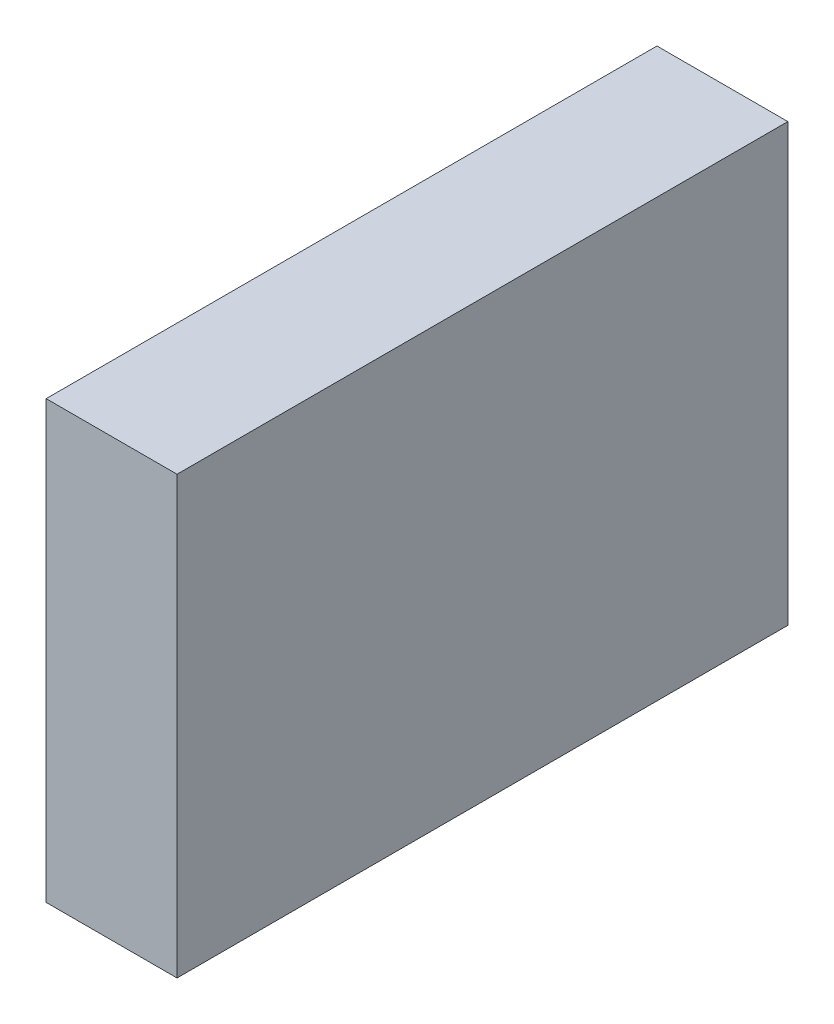
ISO-10303-21;
HEADER;
FILE_DESCRIPTION(('STEP AP214'),'2;1');
FILE_NAME('part.step','',(''),(''),'','','');
FILE_SCHEMA(('AUTOMOTIVE_DESIGN { 1 0 10303 214 1 1 1 1 }'));
ENDSEC;
DATA;
#1=APPLICATION_CONTEXT('core data for automotive mechanical design processes');
#2=APPLICATION_PROTOCOL_DEFINITION('international standard','automotive_design',2000,#1);
#3=PRODUCT_CONTEXT('',#1,'mechanical');
#4=PRODUCT('Part','Part','',(#3));
#5=PRODUCT_RELATED_PRODUCT_CATEGORY('part','',(#4));
#6=PRODUCT_DEFINITION_FORMATION('','',#4);
#7=PRODUCT_DEFINITION_CONTEXT('part definition',#1,'design');
#8=PRODUCT_DEFINITION('design','',#6,#7);
#9=PRODUCT_DEFINITION_SHAPE('','',#8);
#10=(LENGTH_UNIT() NAMED_UNIT(*) SI_UNIT(.MILLI.,.METRE.));
#11=(NAMED_UNIT(*) PLANE_ANGLE_UNIT() SI_UNIT($,.RADIAN.));
#12=(NAMED_UNIT(*) SI_UNIT($,.STERADIAN.) SOLID_ANGLE_UNIT());
#13=UNCERTAINTY_MEASURE_WITH_UNIT(LENGTH_MEASURE(1.E-05),#10,'distance_accuracy_value','');
#14=(GEOMETRIC_REPRESENTATION_CONTEXT(3) GLOBAL_UNCERTAINTY_ASSIGNED_CONTEXT((#13)) GLOBAL_UNIT_ASSIGNED_CONTEXT((#10,
#11,#12)) REPRESENTATION_CONTEXT('',''));
#15=CARTESIAN_POINT('',(0.,0.,0.));
#16=DIRECTION('',(0.,0.,1.));
#17=DIRECTION('',(1.,0.,0.));
#18=AXIS2_PLACEMENT_3D('',#15,#16,#17);
#19=CARTESIAN_POINT('',(9.525,63.5,44.45));
#20=DIRECTION('',(-1.,0.,0.));
#21=DIRECTION('',(0.,0.,1.));
#22=AXIS2_PLACEMENT_3D('',#19,#20,#21);
#23=PLANE('',#22);
#24=DIRECTION('',(0.,0.,-1.));
#25=VECTOR('',#24,1.);
#26=CARTESIAN_POINT('',(9.525,0.,44.45));
#27=LINE('',#26,#25);
#28=CARTESIAN_POINT('',(9.525,0.,44.45));
#29=VERTEX_POINT('',#28);
#30=CARTESIAN_POINT('',(9.525,0.,-44.45));
#31=VERTEX_POINT('',#30);
#32=EDGE_CURVE('E96',#29,#31,#27,.T.);
#33=ORIENTED_EDGE('',*,*,#32,.T.);
#34=DIRECTION('',(0.,-1.,0.));
#35=VECTOR('',#34,1.);
#36=CARTESIAN_POINT('',(9.525,63.5,-44.45));
#37=LINE('',#36,#35);
#38=CARTESIAN_POINT('',(9.525,63.5,-44.45));
#39=VERTEX_POINT('',#38);
#40=EDGE_CURVE('E11',#39,#31,#37,.T.);
#41=ORIENTED_EDGE('',*,*,#40,.F.);
#42=DIRECTION('',(0.,0.,-1.));
#43=VECTOR('',#42,1.);
#44=CARTESIAN_POINT('',(9.525,63.5,44.45));
#45=LINE('',#44,#43);
#46=CARTESIAN_POINT('',(9.525,63.5,44.45));
#47=VERTEX_POINT('',#46);
#48=EDGE_CURVE('E84',#47,#39,#45,.T.);
#49=ORIENTED_EDGE('',*,*,#48,.F.);
#50=DIRECTION('',(0.,-1.,0.));
#51=VECTOR('',#50,1.);
#52=CARTESIAN_POINT('',(9.525,63.5,44.45));
#53=LINE('',#52,#51);
#54=EDGE_CURVE('E92',#47,#29,#53,.T.);
#55=ORIENTED_EDGE('',*,*,#54,.T.);
#56=EDGE_LOOP('',(#33,#41,#49,#55));
#57=FACE_BOUND('',#56,.T.);
#58=ADVANCED_FACE('F33',(#57),#23,.F.);
#59=CARTESIAN_POINT('',(-9.525,63.5,-44.45));
#60=DIRECTION('',(0.,0.,1.));
#61=DIRECTION('',(1.,0.,0.));
#62=AXIS2_PLACEMENT_3D('',#59,#60,#61);
#63=PLANE('',#62);
#64=DIRECTION('',(-1.,0.,0.));
#65=VECTOR('',#64,1.);
#66=CARTESIAN_POINT('',(-9.525,0.,-44.45));
#67=LINE('',#66,#65);
#68=CARTESIAN_POINT('',(-9.525,0.,-44.45));
#69=VERTEX_POINT('',#68);
#70=EDGE_CURVE('E88',#31,#69,#67,.T.);
#71=ORIENTED_EDGE('',*,*,#70,.T.);
#72=DIRECTION('',(0.,-1.,0.));
#73=VECTOR('',#72,1.);
#74=CARTESIAN_POINT('',(-9.525,63.5,-44.45));
#75=LINE('',#74,#73);
#76=CARTESIAN_POINT('',(-9.525,63.5,-44.45));
#77=VERTEX_POINT('',#76);
#78=EDGE_CURVE('E41',#77,#69,#75,.T.);
#79=ORIENTED_EDGE('',*,*,#78,.F.);
#80=DIRECTION('',(-1.,0.,0.));
#81=VECTOR('',#80,1.);
#82=CARTESIAN_POINT('',(-9.525,63.5,-44.45));
#83=LINE('',#82,#81);
#84=EDGE_CURVE('E79',#39,#77,#83,.T.);
#85=ORIENTED_EDGE('',*,*,#84,.F.);
#86=ORIENTED_EDGE('',*,*,#40,.T.);
#87=EDGE_LOOP('',(#71,#79,#85,#86));
#88=FACE_BOUND('',#87,.T.);
#89=ADVANCED_FACE('F87',(#88),#63,.F.);
#90=CARTESIAN_POINT('',(-9.525,63.5,44.45));
#91=DIRECTION('',(1.,0.,0.));
#92=DIRECTION('',(0.,0.,-1.));
#93=AXIS2_PLACEMENT_3D('',#90,#91,#92);
#94=PLANE('',#93);
#95=DIRECTION('',(0.,0.,1.));
#96=VECTOR('',#95,1.);
#97=CARTESIAN_POINT('',(-9.525,0.,44.45));
#98=LINE('',#97,#96);
#99=CARTESIAN_POINT('',(-9.525,0.,44.45));
#100=VERTEX_POINT('',#99);
#101=EDGE_CURVE('E66',#69,#100,#98,.T.);
#102=ORIENTED_EDGE('',*,*,#101,.T.);
#103=DIRECTION('',(0.,-1.,0.));
#104=VECTOR('',#103,1.);
#105=CARTESIAN_POINT('',(-9.525,63.5,44.45));
#106=LINE('',#105,#104);
#107=CARTESIAN_POINT('',(-9.525,63.5,44.45));
#108=VERTEX_POINT('',#107);
#109=EDGE_CURVE('E89',#108,#100,#106,.T.);
#110=ORIENTED_EDGE('',*,*,#109,.F.);
#111=DIRECTION('',(0.,0.,1.));
#112=VECTOR('',#111,1.);
#113=CARTESIAN_POINT('',(-9.525,63.5,44.45));
#114=LINE('',#113,#112);
#115=EDGE_CURVE('E82',#77,#108,#114,.T.);
#116=ORIENTED_EDGE('',*,*,#115,.F.);
#117=ORIENTED_EDGE('',*,*,#78,.T.);
#118=EDGE_LOOP('',(#102,#110,#116,#117));
#119=FACE_BOUND('',#118,.T.);
#120=ADVANCED_FACE('F90',(#119),#94,.F.);
#121=CARTESIAN_POINT('',(-9.525,63.5,44.45));
#122=DIRECTION('',(0.,0.,-1.));
#123=DIRECTION('',(-1.,0.,0.));
#124=AXIS2_PLACEMENT_3D('',#121,#122,#123);
#125=PLANE('',#124);
#126=DIRECTION('',(1.,0.,0.));
#127=VECTOR('',#126,1.);
#128=CARTESIAN_POINT('',(-9.525,0.,44.45));
#129=LINE('',#128,#127);
#130=EDGE_CURVE('E72',#100,#29,#129,.T.);
#131=ORIENTED_EDGE('',*,*,#130,.T.);
#132=ORIENTED_EDGE('',*,*,#54,.F.);
#133=DIRECTION('',(1.,0.,0.));
#134=VECTOR('',#133,1.);
#135=CARTESIAN_POINT('',(-9.525,63.5,44.45));
#136=LINE('',#135,#134);
#137=EDGE_CURVE('E49',#108,#47,#136,.T.);
#138=ORIENTED_EDGE('',*,*,#137,.F.);
#139=ORIENTED_EDGE('',*,*,#109,.T.);
#140=EDGE_LOOP('',(#131,#132,#138,#139));
#141=FACE_BOUND('',#140,.T.);
#142=ADVANCED_FACE('F103',(#141),#125,.F.);
#143=CARTESIAN_POINT('',(0.,63.5,0.));
#144=DIRECTION('',(0.,-1.,0.));
#145=DIRECTION('',(0.,0.,-1.));
#146=AXIS2_PLACEMENT_3D('',#143,#144,#145);
#147=PLANE('',#146);
#148=ORIENTED_EDGE('',*,*,#48,.T.);
#149=ORIENTED_EDGE('',*,*,#84,.T.);
#150=ORIENTED_EDGE('',*,*,#115,.T.);
#151=ORIENTED_EDGE('',*,*,#137,.T.);
#152=EDGE_LOOP('',(#148,#149,#150,#151));
#153=FACE_BOUND('',#152,.T.);
#154=ADVANCED_FACE('F80',(#153),#147,.F.);
#155=CARTESIAN_POINT('',(0.,0.,0.));
#156=DIRECTION('',(0.,-1.,0.));
#157=DIRECTION('',(0.,0.,-1.));
#158=AXIS2_PLACEMENT_3D('',#155,#156,#157);
#159=PLANE('',#158);
#160=ORIENTED_EDGE('',*,*,#32,.F.);
#161=ORIENTED_EDGE('',*,*,#130,.F.);
#162=ORIENTED_EDGE('',*,*,#101,.F.);
#163=ORIENTED_EDGE('',*,*,#70,.F.);
#164=EDGE_LOOP('',(#160,#161,#162,#163));
#165=FACE_BOUND('',#164,.T.);
#166=ADVANCED_FACE('F106',(#165),#159,.T.);
#167=CLOSED_SHELL('',(#58,#89,#120,#142,#154,#166));
#168=MANIFOLD_SOLID_BREP('B2',#167);
#169=ADVANCED_BREP_SHAPE_REPRESENTATION('',(#18,#168),#14);
#170=SHAPE_DEFINITION_REPRESENTATION(#9,#169);
ENDSEC;
END-ISO-10303-21;
